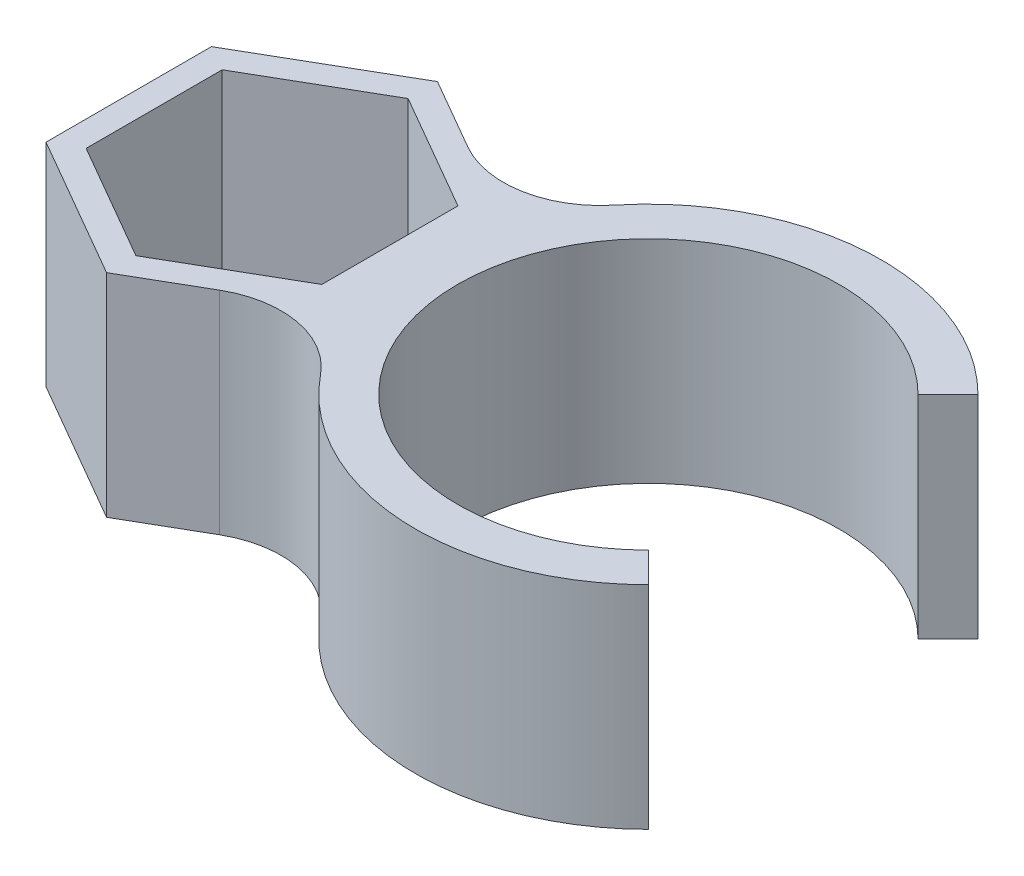
ISO-10303-21;
HEADER;
FILE_DESCRIPTION(('STEP AP214'),'2;1');
FILE_NAME('part.step','',(''),(''),'','','');
FILE_SCHEMA(('AUTOMOTIVE_DESIGN { 1 0 10303 214 1 1 1 1 }'));
ENDSEC;
DATA;
#1=APPLICATION_CONTEXT('core data for automotive mechanical design processes');
#2=APPLICATION_PROTOCOL_DEFINITION('international standard','automotive_design',2000,#1);
#3=PRODUCT_CONTEXT('',#1,'mechanical');
#4=PRODUCT('Part','Part','',(#3));
#5=PRODUCT_RELATED_PRODUCT_CATEGORY('part','',(#4));
#6=PRODUCT_DEFINITION_FORMATION('','',#4);
#7=PRODUCT_DEFINITION_CONTEXT('part definition',#1,'design');
#8=PRODUCT_DEFINITION('design','',#6,#7);
#9=PRODUCT_DEFINITION_SHAPE('','',#8);
#10=(LENGTH_UNIT() NAMED_UNIT(*) SI_UNIT(.MILLI.,.METRE.));
#11=(NAMED_UNIT(*) PLANE_ANGLE_UNIT() SI_UNIT($,.RADIAN.));
#12=(NAMED_UNIT(*) SI_UNIT($,.STERADIAN.) SOLID_ANGLE_UNIT());
#13=UNCERTAINTY_MEASURE_WITH_UNIT(LENGTH_MEASURE(1.E-05),#10,'distance_accuracy_value','');
#14=(GEOMETRIC_REPRESENTATION_CONTEXT(3) GLOBAL_UNCERTAINTY_ASSIGNED_CONTEXT((#13)) GLOBAL_UNIT_ASSIGNED_CONTEXT((#10,
#11,#12)) REPRESENTATION_CONTEXT('',''));
#15=CARTESIAN_POINT('',(0.,0.,0.));
#16=DIRECTION('',(0.,0.,1.));
#17=DIRECTION('',(1.,0.,0.));
#18=AXIS2_PLACEMENT_3D('',#15,#16,#17);
#19=CARTESIAN_POINT('',(5.5626,10.,0.));
#20=DIRECTION('',(-1.,0.,0.));
#21=DIRECTION('',(0.,0.,1.));
#22=AXIS2_PLACEMENT_3D('',#19,#20,#21);
#23=PLANE('',#22);
#24=DIRECTION('',(0.,0.,-1.));
#25=VECTOR('',#24,1.);
#26=CARTESIAN_POINT('',(5.5626,0.,0.));
#27=LINE('',#26,#25);
#28=CARTESIAN_POINT('',(5.5626,0.,3.21156860739421));
#29=VERTEX_POINT('',#28);
#30=CARTESIAN_POINT('',(5.5626,0.,-3.21156860739421));
#31=VERTEX_POINT('',#30);
#32=EDGE_CURVE('E229',#29,#31,#27,.T.);
#33=ORIENTED_EDGE('',*,*,#32,.F.);
#34=DIRECTION('',(0.,-1.,0.));
#35=VECTOR('',#34,1.);
#36=CARTESIAN_POINT('',(5.5626,10.,3.21156860739421));
#37=LINE('',#36,#35);
#38=CARTESIAN_POINT('',(5.5626,10.,3.21156860739421));
#39=VERTEX_POINT('',#38);
#40=EDGE_CURVE('E11',#39,#29,#37,.T.);
#41=ORIENTED_EDGE('',*,*,#40,.F.);
#42=DIRECTION('',(0.,0.,-1.));
#43=VECTOR('',#42,1.);
#44=CARTESIAN_POINT('',(5.5626,10.,0.));
#45=LINE('',#44,#43);
#46=CARTESIAN_POINT('',(5.5626,10.,-3.21156860739421));
#47=VERTEX_POINT('',#46);
#48=EDGE_CURVE('E319',#39,#47,#45,.T.);
#49=ORIENTED_EDGE('',*,*,#48,.T.);
#50=DIRECTION('',(0.,-1.,0.));
#51=VECTOR('',#50,1.);
#52=CARTESIAN_POINT('',(5.5626,10.,-3.21156860739421));
#53=LINE('',#52,#51);
#54=EDGE_CURVE('E58',#47,#31,#53,.T.);
#55=ORIENTED_EDGE('',*,*,#54,.T.);
#56=EDGE_LOOP('',(#33,#41,#49,#55));
#57=FACE_BOUND('',#56,.T.);
#58=ADVANCED_FACE('F39',(#57),#23,.T.);
#59=CARTESIAN_POINT('',(2.7813,10.,4.81735291109132));
#60=DIRECTION('',(-0.5,0.,-0.866025403784438));
#61=DIRECTION('',(-0.866025403784439,0.,0.5));
#62=AXIS2_PLACEMENT_3D('',#59,#60,#61);
#63=PLANE('',#62);
#64=DIRECTION('',(0.866025403784439,0.,-0.5));
#65=VECTOR('',#64,1.);
#66=CARTESIAN_POINT('',(2.7813,0.,4.81735291109132));
#67=LINE('',#66,#65);
#68=CARTESIAN_POINT('',(0.,0.,6.42313721478843));
#69=VERTEX_POINT('',#68);
#70=EDGE_CURVE('E231',#69,#29,#67,.T.);
#71=ORIENTED_EDGE('',*,*,#70,.F.);
#72=DIRECTION('',(0.,-1.,0.));
#73=VECTOR('',#72,1.);
#74=CARTESIAN_POINT('',(0.,10.,6.42313721478843));
#75=LINE('',#74,#73);
#76=CARTESIAN_POINT('',(0.,10.,6.42313721478843));
#77=VERTEX_POINT('',#76);
#78=EDGE_CURVE('E49',#77,#69,#75,.T.);
#79=ORIENTED_EDGE('',*,*,#78,.F.);
#80=DIRECTION('',(0.866025403784439,0.,-0.5));
#81=VECTOR('',#80,1.);
#82=CARTESIAN_POINT('',(2.7813,10.,4.81735291109132));
#83=LINE('',#82,#81);
#84=EDGE_CURVE('E321',#77,#39,#83,.T.);
#85=ORIENTED_EDGE('',*,*,#84,.T.);
#86=ORIENTED_EDGE('',*,*,#40,.T.);
#87=EDGE_LOOP('',(#71,#79,#85,#86));
#88=FACE_BOUND('',#87,.T.);
#89=ADVANCED_FACE('F342',(#88),#63,.T.);
#90=CARTESIAN_POINT('',(-2.7813,10.,4.81735291109132));
#91=DIRECTION('',(0.5,0.,-0.866025403784439));
#92=DIRECTION('',(-0.866025403784439,0.,-0.5));
#93=AXIS2_PLACEMENT_3D('',#90,#91,#92);
#94=PLANE('',#93);
#95=DIRECTION('',(0.866025403784439,0.,0.5));
#96=VECTOR('',#95,1.);
#97=CARTESIAN_POINT('',(-2.7813,0.,4.81735291109132));
#98=LINE('',#97,#96);
#99=CARTESIAN_POINT('',(-5.5626,0.,3.21156860739422));
#100=VERTEX_POINT('',#99);
#101=EDGE_CURVE('E234',#100,#69,#98,.T.);
#102=ORIENTED_EDGE('',*,*,#101,.F.);
#103=DIRECTION('',(0.,-1.,0.));
#104=VECTOR('',#103,1.);
#105=CARTESIAN_POINT('',(-5.5626,10.,3.21156860739422));
#106=LINE('',#105,#104);
#107=CARTESIAN_POINT('',(-5.5626,10.,3.21156860739422));
#108=VERTEX_POINT('',#107);
#109=EDGE_CURVE('E181',#108,#100,#106,.T.);
#110=ORIENTED_EDGE('',*,*,#109,.F.);
#111=DIRECTION('',(0.866025403784439,0.,0.5));
#112=VECTOR('',#111,1.);
#113=CARTESIAN_POINT('',(-2.7813,10.,4.81735291109132));
#114=LINE('',#113,#112);
#115=EDGE_CURVE('E192',#108,#77,#114,.T.);
#116=ORIENTED_EDGE('',*,*,#115,.T.);
#117=ORIENTED_EDGE('',*,*,#78,.T.);
#118=EDGE_LOOP('',(#102,#110,#116,#117));
#119=FACE_BOUND('',#118,.T.);
#120=ADVANCED_FACE('F325',(#119),#94,.T.);
#121=CARTESIAN_POINT('',(-5.5626,10.,0.));
#122=DIRECTION('',(1.,0.,0.));
#123=DIRECTION('',(0.,0.,-1.));
#124=AXIS2_PLACEMENT_3D('',#121,#122,#123);
#125=PLANE('',#124);
#126=DIRECTION('',(0.,0.,1.));
#127=VECTOR('',#126,1.);
#128=CARTESIAN_POINT('',(-5.5626,0.,0.));
#129=LINE('',#128,#127);
#130=CARTESIAN_POINT('',(-5.5626,0.,-3.21156860739421));
#131=VERTEX_POINT('',#130);
#132=EDGE_CURVE('E177',#131,#100,#129,.T.);
#133=ORIENTED_EDGE('',*,*,#132,.F.);
#134=DIRECTION('',(0.,-1.,0.));
#135=VECTOR('',#134,1.);
#136=CARTESIAN_POINT('',(-5.5626,10.,-3.21156860739421));
#137=LINE('',#136,#135);
#138=CARTESIAN_POINT('',(-5.5626,10.,-3.21156860739421));
#139=VERTEX_POINT('',#138);
#140=EDGE_CURVE('E172',#139,#131,#137,.T.);
#141=ORIENTED_EDGE('',*,*,#140,.F.);
#142=DIRECTION('',(0.,0.,1.));
#143=VECTOR('',#142,1.);
#144=CARTESIAN_POINT('',(-5.5626,10.,0.));
#145=LINE('',#144,#143);
#146=EDGE_CURVE('E175',#139,#108,#145,.T.);
#147=ORIENTED_EDGE('',*,*,#146,.T.);
#148=ORIENTED_EDGE('',*,*,#109,.T.);
#149=EDGE_LOOP('',(#133,#141,#147,#148));
#150=FACE_BOUND('',#149,.T.);
#151=ADVANCED_FACE('F174',(#150),#125,.T.);
#152=CARTESIAN_POINT('',(-2.7813,10.,-4.81735291109132));
#153=DIRECTION('',(0.5,0.,0.866025403784438));
#154=DIRECTION('',(0.866025403784439,0.,-0.5));
#155=AXIS2_PLACEMENT_3D('',#152,#153,#154);
#156=PLANE('',#155);
#157=DIRECTION('',(-0.866025403784439,0.,0.5));
#158=VECTOR('',#157,1.);
#159=CARTESIAN_POINT('',(-2.7813,0.,-4.81735291109132));
#160=LINE('',#159,#158);
#161=CARTESIAN_POINT('',(0.,0.,-6.42313721478843));
#162=VERTEX_POINT('',#161);
#163=EDGE_CURVE('E238',#162,#131,#160,.T.);
#164=ORIENTED_EDGE('',*,*,#163,.F.);
#165=DIRECTION('',(0.,-1.,0.));
#166=VECTOR('',#165,1.);
#167=CARTESIAN_POINT('',(0.,10.,-6.42313721478843));
#168=LINE('',#167,#166);
#169=CARTESIAN_POINT('',(0.,10.,-6.42313721478843));
#170=VERTEX_POINT('',#169);
#171=EDGE_CURVE('E113',#170,#162,#168,.T.);
#172=ORIENTED_EDGE('',*,*,#171,.F.);
#173=DIRECTION('',(-0.866025403784439,0.,0.5));
#174=VECTOR('',#173,1.);
#175=CARTESIAN_POINT('',(-2.7813,10.,-4.81735291109132));
#176=LINE('',#175,#174);
#177=EDGE_CURVE('E189',#170,#139,#176,.T.);
#178=ORIENTED_EDGE('',*,*,#177,.T.);
#179=ORIENTED_EDGE('',*,*,#140,.T.);
#180=EDGE_LOOP('',(#164,#172,#178,#179));
#181=FACE_BOUND('',#180,.T.);
#182=ADVANCED_FACE('F194',(#181),#156,.T.);
#183=CARTESIAN_POINT('',(5.67042466098013,10.,9.82146361330911));
#184=DIRECTION('',(0.,-1.,0.));
#185=DIRECTION('',(0.,0.,-1.));
#186=AXIS2_PLACEMENT_3D('',#183,#184,#185);
#187=CYLINDRICAL_SURFACE('',#186,4.57824932196026);
#188=CARTESIAN_POINT('',(5.67042466098013,0.,9.82146361330911));
#189=DIRECTION('',(0.,1.,0.));
#190=DIRECTION('',(0.,0.,1.));
#191=AXIS2_PLACEMENT_3D('',#188,#189,#190);
#192=CIRCLE('',#191,4.57824932196026);
#193=CARTESIAN_POINT('',(3.3813,0.,5.85658339563265));
#194=VERTEX_POINT('',#193);
#195=CARTESIAN_POINT('',(9.2241611818645,0.,6.93506038538647));
#196=VERTEX_POINT('',#195);
#197=EDGE_CURVE('E201',#194,#196,#192,.F.);
#198=ORIENTED_EDGE('',*,*,#197,.T.);
#199=DIRECTION('',(0.,-1.,0.));
#200=VECTOR('',#199,1.);
#201=CARTESIAN_POINT('',(9.2241611818645,10.,6.93506038538647));
#202=LINE('',#201,#200);
#203=CARTESIAN_POINT('',(9.2241611818645,10.,6.93506038538647));
#204=VERTEX_POINT('',#203);
#205=EDGE_CURVE('E43',#204,#196,#202,.T.);
#206=ORIENTED_EDGE('',*,*,#205,.F.);
#207=CARTESIAN_POINT('',(5.67042466098013,10.,9.82146361330911));
#208=DIRECTION('',(0.,1.,0.));
#209=DIRECTION('',(0.,0.,1.));
#210=AXIS2_PLACEMENT_3D('',#207,#208,#209);
#211=CIRCLE('',#210,4.57824932196026);
#212=CARTESIAN_POINT('',(3.3813,10.,5.85658339563265));
#213=VERTEX_POINT('',#212);
#214=EDGE_CURVE('E243',#213,#204,#211,.F.);
#215=ORIENTED_EDGE('',*,*,#214,.F.);
#216=DIRECTION('',(0.,-1.,0.));
#217=VECTOR('',#216,1.);
#218=CARTESIAN_POINT('',(3.3813,10.,5.85658339563265));
#219=LINE('',#218,#217);
#220=EDGE_CURVE('E197',#213,#194,#219,.T.);
#221=ORIENTED_EDGE('',*,*,#220,.T.);
#222=EDGE_LOOP('',(#198,#206,#215,#221));
#223=FACE_BOUND('',#222,.T.);
#224=ADVANCED_FACE('F41',(#223),#187,.F.);
#225=CARTESIAN_POINT('',(17.7626,10.,0.));
#226=DIRECTION('',(0.,-1.,0.));
#227=DIRECTION('',(0.,0.,-1.));
#228=AXIS2_PLACEMENT_3D('',#225,#226,#227);
#229=CYLINDRICAL_SURFACE('',#228,11.);
#230=CARTESIAN_POINT('',(17.7626,0.,0.));
#231=DIRECTION('',(0.,1.,0.));
#232=DIRECTION('',(0.,0.,1.));
#233=AXIS2_PLACEMENT_3D('',#230,#231,#232);
#234=CIRCLE('',#233,11.);
#235=CARTESIAN_POINT('',(25.540774593052,0.,7.77817459305203));
#236=VERTEX_POINT('',#235);
#237=EDGE_CURVE('E204',#196,#236,#234,.T.);
#238=ORIENTED_EDGE('',*,*,#237,.T.);
#239=DIRECTION('',(0.,-1.,0.));
#240=VECTOR('',#239,1.);
#241=CARTESIAN_POINT('',(25.540774593052,10.,7.77817459305203));
#242=LINE('',#241,#240);
#243=CARTESIAN_POINT('',(25.540774593052,10.,7.77817459305203));
#244=VERTEX_POINT('',#243);
#245=EDGE_CURVE('E272',#244,#236,#242,.T.);
#246=ORIENTED_EDGE('',*,*,#245,.F.);
#247=CARTESIAN_POINT('',(17.7626,10.,0.));
#248=DIRECTION('',(0.,1.,0.));
#249=DIRECTION('',(0.,0.,1.));
#250=AXIS2_PLACEMENT_3D('',#247,#248,#249);
#251=CIRCLE('',#250,11.);
#252=EDGE_CURVE('E126',#204,#244,#251,.T.);
#253=ORIENTED_EDGE('',*,*,#252,.F.);
#254=ORIENTED_EDGE('',*,*,#205,.T.);
#255=EDGE_LOOP('',(#238,#246,#253,#254));
#256=FACE_BOUND('',#255,.T.);
#257=ADVANCED_FACE('F277',(#256),#229,.T.);
#258=CARTESIAN_POINT('',(8.88130000000007,10.,-8.88130000000001));
#259=DIRECTION('',(0.70710678118655,0.,-0.707106781186545));
#260=DIRECTION('',(-0.707106781186545,0.,-0.70710678118655));
#261=AXIS2_PLACEMENT_3D('',#258,#259,#260);
#262=PLANE('',#261);
#263=DIRECTION('',(0.707106781186545,0.,0.70710678118655));
#264=VECTOR('',#263,1.);
#265=CARTESIAN_POINT('',(8.88130000000007,0.,-8.88130000000001));
#266=LINE('',#265,#264);
#267=CARTESIAN_POINT('',(24.1265610306789,0.,6.36396103067893));
#268=VERTEX_POINT('',#267);
#269=EDGE_CURVE('E207',#268,#236,#266,.T.);
#270=ORIENTED_EDGE('',*,*,#269,.F.);
#271=DIRECTION('',(0.,-1.,0.));
#272=VECTOR('',#271,1.);
#273=CARTESIAN_POINT('',(24.1265610306789,10.,6.36396103067893));
#274=LINE('',#273,#272);
#275=CARTESIAN_POINT('',(24.1265610306789,10.,6.36396103067893));
#276=VERTEX_POINT('',#275);
#277=EDGE_CURVE('E271',#276,#268,#274,.T.);
#278=ORIENTED_EDGE('',*,*,#277,.F.);
#279=DIRECTION('',(0.707106781186545,0.,0.70710678118655));
#280=VECTOR('',#279,1.);
#281=CARTESIAN_POINT('',(8.88130000000007,10.,-8.88130000000001));
#282=LINE('',#281,#280);
#283=EDGE_CURVE('E291',#276,#244,#282,.T.);
#284=ORIENTED_EDGE('',*,*,#283,.T.);
#285=ORIENTED_EDGE('',*,*,#245,.T.);
#286=EDGE_LOOP('',(#270,#278,#284,#285));
#287=FACE_BOUND('',#286,.T.);
#288=ADVANCED_FACE('F289',(#287),#262,.T.);
#289=CARTESIAN_POINT('',(17.7626,10.,0.));
#290=DIRECTION('',(0.,-1.,0.));
#291=DIRECTION('',(0.,0.,-1.));
#292=AXIS2_PLACEMENT_3D('',#289,#290,#291);
#293=CYLINDRICAL_SURFACE('',#292,9.);
#294=CARTESIAN_POINT('',(17.7626,0.,0.));
#295=DIRECTION('',(0.,1.,0.));
#296=DIRECTION('',(0.,0.,1.));
#297=AXIS2_PLACEMENT_3D('',#294,#295,#296);
#298=CIRCLE('',#297,9.);
#299=CARTESIAN_POINT('',(24.1265610306789,0.,-6.36396103067894));
#300=VERTEX_POINT('',#299);
#301=EDGE_CURVE('E211',#300,#268,#298,.T.);
#302=ORIENTED_EDGE('',*,*,#301,.F.);
#303=DIRECTION('',(0.,-1.,0.));
#304=VECTOR('',#303,1.);
#305=CARTESIAN_POINT('',(24.1265610306789,10.,-6.36396103067894));
#306=LINE('',#305,#304);
#307=CARTESIAN_POINT('',(24.1265610306789,10.,-6.36396103067894));
#308=VERTEX_POINT('',#307);
#309=EDGE_CURVE('E269',#308,#300,#306,.T.);
#310=ORIENTED_EDGE('',*,*,#309,.F.);
#311=CARTESIAN_POINT('',(17.7626,10.,0.));
#312=DIRECTION('',(0.,1.,0.));
#313=DIRECTION('',(0.,0.,1.));
#314=AXIS2_PLACEMENT_3D('',#311,#312,#313);
#315=CIRCLE('',#314,9.);
#316=EDGE_CURVE('E296',#308,#276,#315,.T.);
#317=ORIENTED_EDGE('',*,*,#316,.T.);
#318=ORIENTED_EDGE('',*,*,#277,.T.);
#319=EDGE_LOOP('',(#302,#310,#317,#318));
#320=FACE_BOUND('',#319,.T.);
#321=ADVANCED_FACE('F298',(#320),#293,.F.);
#322=CARTESIAN_POINT('',(8.88130000000008,10.,8.88130000000001));
#323=DIRECTION('',(-0.70710678118655,0.,-0.707106781186545));
#324=DIRECTION('',(-0.707106781186545,0.,0.70710678118655));
#325=AXIS2_PLACEMENT_3D('',#322,#323,#324);
#326=PLANE('',#325);
#327=DIRECTION('',(0.707106781186545,0.,-0.70710678118655));
#328=VECTOR('',#327,1.);
#329=CARTESIAN_POINT('',(8.88130000000008,0.,8.88130000000001));
#330=LINE('',#329,#328);
#331=CARTESIAN_POINT('',(25.540774593052,0.,-7.77817459305204));
#332=VERTEX_POINT('',#331);
#333=EDGE_CURVE('E214',#300,#332,#330,.T.);
#334=ORIENTED_EDGE('',*,*,#333,.T.);
#335=DIRECTION('',(0.,-1.,0.));
#336=VECTOR('',#335,1.);
#337=CARTESIAN_POINT('',(25.540774593052,10.,-7.77817459305204));
#338=LINE('',#337,#336);
#339=CARTESIAN_POINT('',(25.540774593052,10.,-7.77817459305204));
#340=VERTEX_POINT('',#339);
#341=EDGE_CURVE('E266',#340,#332,#338,.T.);
#342=ORIENTED_EDGE('',*,*,#341,.F.);
#343=DIRECTION('',(0.707106781186545,0.,-0.70710678118655));
#344=VECTOR('',#343,1.);
#345=CARTESIAN_POINT('',(8.88130000000008,10.,8.88130000000001));
#346=LINE('',#345,#344);
#347=EDGE_CURVE('E300',#308,#340,#346,.T.);
#348=ORIENTED_EDGE('',*,*,#347,.F.);
#349=ORIENTED_EDGE('',*,*,#309,.T.);
#350=EDGE_LOOP('',(#334,#342,#348,#349));
#351=FACE_BOUND('',#350,.T.);
#352=ADVANCED_FACE('F373',(#351),#326,.F.);
#353=CARTESIAN_POINT('',(9.2241611818645,0.,-6.93506038538647));
#354=VERTEX_POINT('',#353);
#355=EDGE_CURVE('E208',#332,#354,#234,.T.);
#356=ORIENTED_EDGE('',*,*,#355,.T.);
#357=DIRECTION('',(0.,-1.,0.));
#358=VECTOR('',#357,1.);
#359=CARTESIAN_POINT('',(9.2241611818645,10.,-6.93506038538647));
#360=LINE('',#359,#358);
#361=CARTESIAN_POINT('',(9.2241611818645,10.,-6.93506038538647));
#362=VERTEX_POINT('',#361);
#363=EDGE_CURVE('E264',#362,#354,#360,.T.);
#364=ORIENTED_EDGE('',*,*,#363,.F.);
#365=EDGE_CURVE('E302',#340,#362,#251,.T.);
#366=ORIENTED_EDGE('',*,*,#365,.F.);
#367=ORIENTED_EDGE('',*,*,#341,.T.);
#368=EDGE_LOOP('',(#356,#364,#366,#367));
#369=FACE_BOUND('',#368,.T.);
#370=ADVANCED_FACE('F369',(#369),#229,.T.);
#371=CARTESIAN_POINT('',(5.67042466098013,10.,-9.82146361330911));
#372=DIRECTION('',(0.,-1.,0.));
#373=DIRECTION('',(0.,0.,-1.));
#374=AXIS2_PLACEMENT_3D('',#371,#372,#373);
#375=CYLINDRICAL_SURFACE('',#374,4.57824932196026);
#376=CARTESIAN_POINT('',(5.67042466098013,0.,-9.82146361330911));
#377=DIRECTION('',(0.,1.,0.));
#378=DIRECTION('',(0.,0.,1.));
#379=AXIS2_PLACEMENT_3D('',#376,#377,#378);
#380=CIRCLE('',#379,4.57824932196026);
#381=CARTESIAN_POINT('',(3.3813,0.,-5.85658339563264));
#382=VERTEX_POINT('',#381);
#383=EDGE_CURVE('E216',#382,#354,#380,.T.);
#384=ORIENTED_EDGE('',*,*,#383,.F.);
#385=DIRECTION('',(0.,-1.,0.));
#386=VECTOR('',#385,1.);
#387=CARTESIAN_POINT('',(3.3813,10.,-5.85658339563264));
#388=LINE('',#387,#386);
#389=CARTESIAN_POINT('',(3.3813,10.,-5.85658339563264));
#390=VERTEX_POINT('',#389);
#391=EDGE_CURVE('E262',#390,#382,#388,.T.);
#392=ORIENTED_EDGE('',*,*,#391,.F.);
#393=CARTESIAN_POINT('',(5.67042466098013,10.,-9.82146361330911));
#394=DIRECTION('',(0.,1.,0.));
#395=DIRECTION('',(0.,0.,1.));
#396=AXIS2_PLACEMENT_3D('',#393,#394,#395);
#397=CIRCLE('',#396,4.57824932196026);
#398=EDGE_CURVE('E306',#390,#362,#397,.T.);
#399=ORIENTED_EDGE('',*,*,#398,.T.);
#400=ORIENTED_EDGE('',*,*,#363,.T.);
#401=EDGE_LOOP('',(#384,#392,#399,#400));
#402=FACE_BOUND('',#401,.T.);
#403=ADVANCED_FACE('F365',(#402),#375,.F.);
#404=CARTESIAN_POINT('',(3.3813,10.,-5.85658339563265));
#405=DIRECTION('',(-0.5,0.,0.866025403784439));
#406=DIRECTION('',(0.866025403784439,0.,0.5));
#407=AXIS2_PLACEMENT_3D('',#404,#405,#406);
#408=PLANE('',#407);
#409=DIRECTION('',(-0.866025403784439,0.,-0.5));
#410=VECTOR('',#409,1.);
#411=CARTESIAN_POINT('',(3.3813,0.,-5.85658339563265));
#412=LINE('',#411,#410);
#413=CARTESIAN_POINT('',(0.,0.,-7.80877786084353));
#414=VERTEX_POINT('',#413);
#415=EDGE_CURVE('E219',#382,#414,#412,.T.);
#416=ORIENTED_EDGE('',*,*,#415,.T.);
#417=DIRECTION('',(0.,-1.,0.));
#418=VECTOR('',#417,1.);
#419=CARTESIAN_POINT('',(0.,10.,-7.80877786084353));
#420=LINE('',#419,#418);
#421=CARTESIAN_POINT('',(0.,10.,-7.80877786084353));
#422=VERTEX_POINT('',#421);
#423=EDGE_CURVE('E259',#422,#414,#420,.T.);
#424=ORIENTED_EDGE('',*,*,#423,.F.);
#425=DIRECTION('',(-0.866025403784439,0.,-0.5));
#426=VECTOR('',#425,1.);
#427=CARTESIAN_POINT('',(3.3813,10.,-5.85658339563265));
#428=LINE('',#427,#426);
#429=EDGE_CURVE('E309',#390,#422,#428,.T.);
#430=ORIENTED_EDGE('',*,*,#429,.F.);
#431=ORIENTED_EDGE('',*,*,#391,.T.);
#432=EDGE_LOOP('',(#416,#424,#430,#431));
#433=FACE_BOUND('',#432,.T.);
#434=ADVANCED_FACE('F361',(#433),#408,.F.);
#435=CARTESIAN_POINT('',(-3.3813,10.,-5.85658339563265));
#436=DIRECTION('',(0.5,0.,0.866025403784438));
#437=DIRECTION('',(0.866025403784439,0.,-0.5));
#438=AXIS2_PLACEMENT_3D('',#435,#436,#437);
#439=PLANE('',#438);
#440=DIRECTION('',(-0.866025403784439,0.,0.5));
#441=VECTOR('',#440,1.);
#442=CARTESIAN_POINT('',(-3.3813,0.,-5.85658339563265));
#443=LINE('',#442,#441);
#444=CARTESIAN_POINT('',(-6.7626,0.,-3.90438893042176));
#445=VERTEX_POINT('',#444);
#446=EDGE_CURVE('E221',#414,#445,#443,.T.);
#447=ORIENTED_EDGE('',*,*,#446,.T.);
#448=DIRECTION('',(0.,-1.,0.));
#449=VECTOR('',#448,1.);
#450=CARTESIAN_POINT('',(-6.7626,10.,-3.90438893042176));
#451=LINE('',#450,#449);
#452=CARTESIAN_POINT('',(-6.7626,10.,-3.90438893042176));
#453=VERTEX_POINT('',#452);
#454=EDGE_CURVE('E256',#453,#445,#451,.T.);
#455=ORIENTED_EDGE('',*,*,#454,.F.);
#456=DIRECTION('',(-0.866025403784439,0.,0.5));
#457=VECTOR('',#456,1.);
#458=CARTESIAN_POINT('',(-3.3813,10.,-5.85658339563265));
#459=LINE('',#458,#457);
#460=EDGE_CURVE('E311',#422,#453,#459,.T.);
#461=ORIENTED_EDGE('',*,*,#460,.F.);
#462=ORIENTED_EDGE('',*,*,#423,.T.);
#463=EDGE_LOOP('',(#447,#455,#461,#462));
#464=FACE_BOUND('',#463,.T.);
#465=ADVANCED_FACE('F357',(#464),#439,.F.);
#466=CARTESIAN_POINT('',(-6.7626,10.,0.));
#467=DIRECTION('',(1.,0.,0.));
#468=DIRECTION('',(0.,0.,-1.));
#469=AXIS2_PLACEMENT_3D('',#466,#467,#468);
#470=PLANE('',#469);
#471=DIRECTION('',(0.,0.,1.));
#472=VECTOR('',#471,1.);
#473=CARTESIAN_POINT('',(-6.7626,0.,0.));
#474=LINE('',#473,#472);
#475=CARTESIAN_POINT('',(-6.7626,0.,3.90438893042176));
#476=VERTEX_POINT('',#475);
#477=EDGE_CURVE('E223',#445,#476,#474,.T.);
#478=ORIENTED_EDGE('',*,*,#477,.T.);
#479=DIRECTION('',(0.,-1.,0.));
#480=VECTOR('',#479,1.);
#481=CARTESIAN_POINT('',(-6.7626,10.,3.90438893042176));
#482=LINE('',#481,#480);
#483=CARTESIAN_POINT('',(-6.7626,10.,3.90438893042176));
#484=VERTEX_POINT('',#483);
#485=EDGE_CURVE('E253',#484,#476,#482,.T.);
#486=ORIENTED_EDGE('',*,*,#485,.F.);
#487=DIRECTION('',(0.,0.,1.));
#488=VECTOR('',#487,1.);
#489=CARTESIAN_POINT('',(-6.7626,10.,0.));
#490=LINE('',#489,#488);
#491=EDGE_CURVE('E313',#453,#484,#490,.T.);
#492=ORIENTED_EDGE('',*,*,#491,.F.);
#493=ORIENTED_EDGE('',*,*,#454,.T.);
#494=EDGE_LOOP('',(#478,#486,#492,#493));
#495=FACE_BOUND('',#494,.T.);
#496=ADVANCED_FACE('F353',(#495),#470,.F.);
#497=CARTESIAN_POINT('',(-3.38129999999999,10.,5.85658339563264));
#498=DIRECTION('',(0.499999999999999,0.,-0.866025403784439));
#499=DIRECTION('',(-0.866025403784439,0.,-0.499999999999999));
#500=AXIS2_PLACEMENT_3D('',#497,#498,#499);
#501=PLANE('',#500);
#502=DIRECTION('',(0.866025403784439,0.,0.499999999999999));
#503=VECTOR('',#502,1.);
#504=CARTESIAN_POINT('',(-3.38129999999999,0.,5.85658339563264));
#505=LINE('',#504,#503);
#506=CARTESIAN_POINT('',(0.,0.,7.80877786084352));
#507=VERTEX_POINT('',#506);
#508=EDGE_CURVE('E225',#476,#507,#505,.T.);
#509=ORIENTED_EDGE('',*,*,#508,.T.);
#510=DIRECTION('',(0.,-1.,0.));
#511=VECTOR('',#510,1.);
#512=CARTESIAN_POINT('',(0.,10.,7.80877786084352));
#513=LINE('',#512,#511);
#514=CARTESIAN_POINT('',(0.,10.,7.80877786084352));
#515=VERTEX_POINT('',#514);
#516=EDGE_CURVE('E250',#515,#507,#513,.T.);
#517=ORIENTED_EDGE('',*,*,#516,.F.);
#518=DIRECTION('',(0.866025403784439,0.,0.499999999999999));
#519=VECTOR('',#518,1.);
#520=CARTESIAN_POINT('',(-3.38129999999999,10.,5.85658339563264));
#521=LINE('',#520,#519);
#522=EDGE_CURVE('E315',#484,#515,#521,.T.);
#523=ORIENTED_EDGE('',*,*,#522,.F.);
#524=ORIENTED_EDGE('',*,*,#485,.T.);
#525=EDGE_LOOP('',(#509,#517,#523,#524));
#526=FACE_BOUND('',#525,.T.);
#527=ADVANCED_FACE('F336',(#526),#501,.F.);
#528=CARTESIAN_POINT('',(3.3813,10.,5.85658339563265));
#529=DIRECTION('',(-0.5,0.,-0.866025403784438));
#530=DIRECTION('',(-0.866025403784438,0.,0.5));
#531=AXIS2_PLACEMENT_3D('',#528,#529,#530);
#532=PLANE('',#531);
#533=DIRECTION('',(0.866025403784438,0.,-0.5));
#534=VECTOR('',#533,1.);
#535=CARTESIAN_POINT('',(3.3813,0.,5.85658339563265));
#536=LINE('',#535,#534);
#537=EDGE_CURVE('E227',#507,#194,#536,.T.);
#538=ORIENTED_EDGE('',*,*,#537,.T.);
#539=ORIENTED_EDGE('',*,*,#220,.F.);
#540=DIRECTION('',(0.866025403784438,0.,-0.5));
#541=VECTOR('',#540,1.);
#542=CARTESIAN_POINT('',(3.3813,10.,5.85658339563265));
#543=LINE('',#542,#541);
#544=EDGE_CURVE('E317',#515,#213,#543,.T.);
#545=ORIENTED_EDGE('',*,*,#544,.F.);
#546=ORIENTED_EDGE('',*,*,#516,.T.);
#547=EDGE_LOOP('',(#538,#539,#545,#546));
#548=FACE_BOUND('',#547,.T.);
#549=ADVANCED_FACE('F329',(#548),#532,.F.);
#550=CARTESIAN_POINT('',(2.7813,10.,-4.81735291109132));
#551=DIRECTION('',(-0.5,0.,0.866025403784439));
#552=DIRECTION('',(0.866025403784439,0.,0.5));
#553=AXIS2_PLACEMENT_3D('',#550,#551,#552);
#554=PLANE('',#553);
#555=DIRECTION('',(-0.866025403784439,0.,-0.5));
#556=VECTOR('',#555,1.);
#557=CARTESIAN_POINT('',(2.7813,0.,-4.81735291109132));
#558=LINE('',#557,#556);
#559=EDGE_CURVE('E240',#31,#162,#558,.T.);
#560=ORIENTED_EDGE('',*,*,#559,.F.);
#561=ORIENTED_EDGE('',*,*,#54,.F.);
#562=DIRECTION('',(-0.866025403784439,0.,-0.5));
#563=VECTOR('',#562,1.);
#564=CARTESIAN_POINT('',(2.7813,10.,-4.81735291109132));
#565=LINE('',#564,#563);
#566=EDGE_CURVE('E195',#47,#170,#565,.T.);
#567=ORIENTED_EDGE('',*,*,#566,.T.);
#568=ORIENTED_EDGE('',*,*,#171,.T.);
#569=EDGE_LOOP('',(#560,#561,#567,#568));
#570=FACE_BOUND('',#569,.T.);
#571=ADVANCED_FACE('F327',(#570),#554,.T.);
#572=CARTESIAN_POINT('',(0.,10.,0.));
#573=DIRECTION('',(0.,1.,0.));
#574=DIRECTION('',(0.,0.,1.));
#575=AXIS2_PLACEMENT_3D('',#572,#573,#574);
#576=PLANE('',#575);
#577=ORIENTED_EDGE('',*,*,#214,.T.);
#578=ORIENTED_EDGE('',*,*,#252,.T.);
#579=ORIENTED_EDGE('',*,*,#283,.F.);
#580=ORIENTED_EDGE('',*,*,#316,.F.);
#581=ORIENTED_EDGE('',*,*,#347,.T.);
#582=ORIENTED_EDGE('',*,*,#365,.T.);
#583=ORIENTED_EDGE('',*,*,#398,.F.);
#584=ORIENTED_EDGE('',*,*,#429,.T.);
#585=ORIENTED_EDGE('',*,*,#460,.T.);
#586=ORIENTED_EDGE('',*,*,#491,.T.);
#587=ORIENTED_EDGE('',*,*,#522,.T.);
#588=ORIENTED_EDGE('',*,*,#544,.T.);
#589=EDGE_LOOP('',(#577,#578,#579,#580,#581,#582,#583,#584,#585,#586,#587,#588));
#590=FACE_BOUND('',#589,.T.);
#591=ORIENTED_EDGE('',*,*,#48,.F.);
#592=ORIENTED_EDGE('',*,*,#84,.F.);
#593=ORIENTED_EDGE('',*,*,#115,.F.);
#594=ORIENTED_EDGE('',*,*,#146,.F.);
#595=ORIENTED_EDGE('',*,*,#177,.F.);
#596=ORIENTED_EDGE('',*,*,#566,.F.);
#597=EDGE_LOOP('',(#591,#592,#593,#594,#595,#596));
#598=FACE_BOUND('',#597,.T.);
#599=ADVANCED_FACE('F187',(#590,#598),#576,.T.);
#600=CARTESIAN_POINT('',(0.,0.,0.));
#601=DIRECTION('',(0.,1.,0.));
#602=DIRECTION('',(0.,0.,1.));
#603=AXIS2_PLACEMENT_3D('',#600,#601,#602);
#604=PLANE('',#603);
#605=ORIENTED_EDGE('',*,*,#197,.F.);
#606=ORIENTED_EDGE('',*,*,#537,.F.);
#607=ORIENTED_EDGE('',*,*,#508,.F.);
#608=ORIENTED_EDGE('',*,*,#477,.F.);
#609=ORIENTED_EDGE('',*,*,#446,.F.);
#610=ORIENTED_EDGE('',*,*,#415,.F.);
#611=ORIENTED_EDGE('',*,*,#383,.T.);
#612=ORIENTED_EDGE('',*,*,#355,.F.);
#613=ORIENTED_EDGE('',*,*,#333,.F.);
#614=ORIENTED_EDGE('',*,*,#301,.T.);
#615=ORIENTED_EDGE('',*,*,#269,.T.);
#616=ORIENTED_EDGE('',*,*,#237,.F.);
#617=EDGE_LOOP('',(#605,#606,#607,#608,#609,#610,#611,#612,#613,#614,#615,#616));
#618=FACE_BOUND('',#617,.T.);
#619=ORIENTED_EDGE('',*,*,#32,.T.);
#620=ORIENTED_EDGE('',*,*,#559,.T.);
#621=ORIENTED_EDGE('',*,*,#163,.T.);
#622=ORIENTED_EDGE('',*,*,#132,.T.);
#623=ORIENTED_EDGE('',*,*,#101,.T.);
#624=ORIENTED_EDGE('',*,*,#70,.T.);
#625=EDGE_LOOP('',(#619,#620,#621,#622,#623,#624));
#626=FACE_BOUND('',#625,.T.);
#627=ADVANCED_FACE('F284',(#618,#626),#604,.F.);
#628=CLOSED_SHELL('',(#58,#89,#120,#151,#182,#224,#257,#288,#321,#352,#370,#403,#434,#465,#496,
#527,#549,#571,#599,#627));
#629=MANIFOLD_SOLID_BREP('B2',#628);
#630=ADVANCED_BREP_SHAPE_REPRESENTATION('',(#18,#629),#14);
#631=SHAPE_DEFINITION_REPRESENTATION(#9,#630);
ENDSEC;
END-ISO-10303-21;
